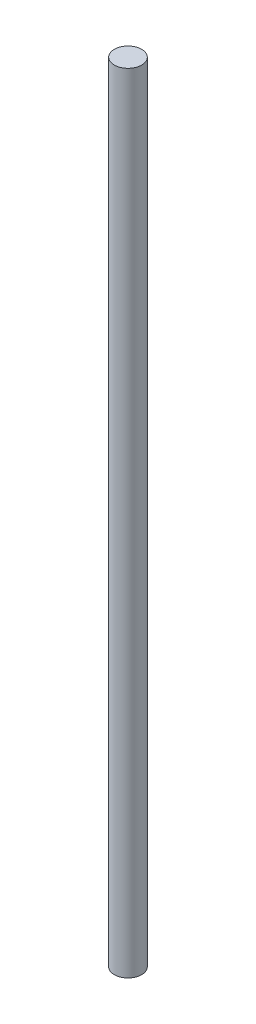
ISO-10303-21;
HEADER;
FILE_DESCRIPTION(('STEP AP214'),'2;1');
FILE_NAME('part.step','',(''),(''),'','','');
FILE_SCHEMA(('AUTOMOTIVE_DESIGN { 1 0 10303 214 1 1 1 1 }'));
ENDSEC;
DATA;
#1=APPLICATION_CONTEXT('core data for automotive mechanical design processes');
#2=APPLICATION_PROTOCOL_DEFINITION('international standard','automotive_design',2000,#1);
#3=PRODUCT_CONTEXT('',#1,'mechanical');
#4=PRODUCT('Part','Part','',(#3));
#5=PRODUCT_RELATED_PRODUCT_CATEGORY('part','',(#4));
#6=PRODUCT_DEFINITION_FORMATION('','',#4);
#7=PRODUCT_DEFINITION_CONTEXT('part definition',#1,'design');
#8=PRODUCT_DEFINITION('design','',#6,#7);
#9=PRODUCT_DEFINITION_SHAPE('','',#8);
#10=(LENGTH_UNIT() NAMED_UNIT(*) SI_UNIT(.MILLI.,.METRE.));
#11=(NAMED_UNIT(*) PLANE_ANGLE_UNIT() SI_UNIT($,.RADIAN.));
#12=(NAMED_UNIT(*) SI_UNIT($,.STERADIAN.) SOLID_ANGLE_UNIT());
#13=UNCERTAINTY_MEASURE_WITH_UNIT(LENGTH_MEASURE(1.E-05),#10,'distance_accuracy_value','');
#14=(GEOMETRIC_REPRESENTATION_CONTEXT(3) GLOBAL_UNCERTAINTY_ASSIGNED_CONTEXT((#13)) GLOBAL_UNIT_ASSIGNED_CONTEXT((#10,
#11,#12)) REPRESENTATION_CONTEXT('',''));
#15=CARTESIAN_POINT('',(0.,0.,0.));
#16=DIRECTION('',(0.,0.,1.));
#17=DIRECTION('',(1.,0.,0.));
#18=AXIS2_PLACEMENT_3D('',#15,#16,#17);
#19=CARTESIAN_POINT('',(0.,228.6,0.));
#20=DIRECTION('',(0.,-1.,0.));
#21=DIRECTION('',(0.,0.,-1.));
#22=AXIS2_PLACEMENT_3D('',#19,#20,#21);
#23=CYLINDRICAL_SURFACE('',#22,3.96875);
#24=CARTESIAN_POINT('',(0.,228.6,0.));
#25=DIRECTION('',(0.,1.,0.));
#26=DIRECTION('',(0.,0.,1.));
#27=AXIS2_PLACEMENT_3D('',#24,#25,#26);
#28=CIRCLE('',#27,3.96875);
#29=CARTESIAN_POINT('',(0.,228.6,3.96875));
#30=VERTEX_POINT('',#29);
#31=EDGE_CURVE('E10',#30,#30,#28,.T.);
#32=ORIENTED_EDGE('',*,*,#31,.F.);
#33=EDGE_LOOP('',(#32));
#34=FACE_BOUND('',#33,.T.);
#35=CARTESIAN_POINT('',(0.,0.,0.));
#36=DIRECTION('',(0.,1.,0.));
#37=DIRECTION('',(0.,0.,1.));
#38=AXIS2_PLACEMENT_3D('',#35,#36,#37);
#39=CIRCLE('',#38,3.96875);
#40=CARTESIAN_POINT('',(0.,0.,3.96875));
#41=VERTEX_POINT('',#40);
#42=EDGE_CURVE('E34',#41,#41,#39,.T.);
#43=ORIENTED_EDGE('',*,*,#42,.T.);
#44=EDGE_LOOP('',(#43));
#45=FACE_BOUND('',#44,.T.);
#46=ADVANCED_FACE('F31',(#34,#45),#23,.T.);
#47=CARTESIAN_POINT('',(0.,228.6,0.));
#48=DIRECTION('',(0.,1.,0.));
#49=DIRECTION('',(0.,0.,1.));
#50=AXIS2_PLACEMENT_3D('',#47,#48,#49);
#51=PLANE('',#50);
#52=ORIENTED_EDGE('',*,*,#31,.T.);
#53=EDGE_LOOP('',(#52));
#54=FACE_BOUND('',#53,.T.);
#55=ADVANCED_FACE('F46',(#54),#51,.T.);
#56=CARTESIAN_POINT('',(0.,0.,0.));
#57=DIRECTION('',(0.,1.,0.));
#58=DIRECTION('',(0.,0.,1.));
#59=AXIS2_PLACEMENT_3D('',#56,#57,#58);
#60=PLANE('',#59);
#61=ORIENTED_EDGE('',*,*,#42,.F.);
#62=EDGE_LOOP('',(#61));
#63=FACE_BOUND('',#62,.T.);
#64=ADVANCED_FACE('F44',(#63),#60,.F.);
#65=CLOSED_SHELL('',(#46,#55,#64));
#66=MANIFOLD_SOLID_BREP('B2',#65);
#67=ADVANCED_BREP_SHAPE_REPRESENTATION('',(#18,#66),#14);
#68=SHAPE_DEFINITION_REPRESENTATION(#9,#67);
ENDSEC;
END-ISO-10303-21;
